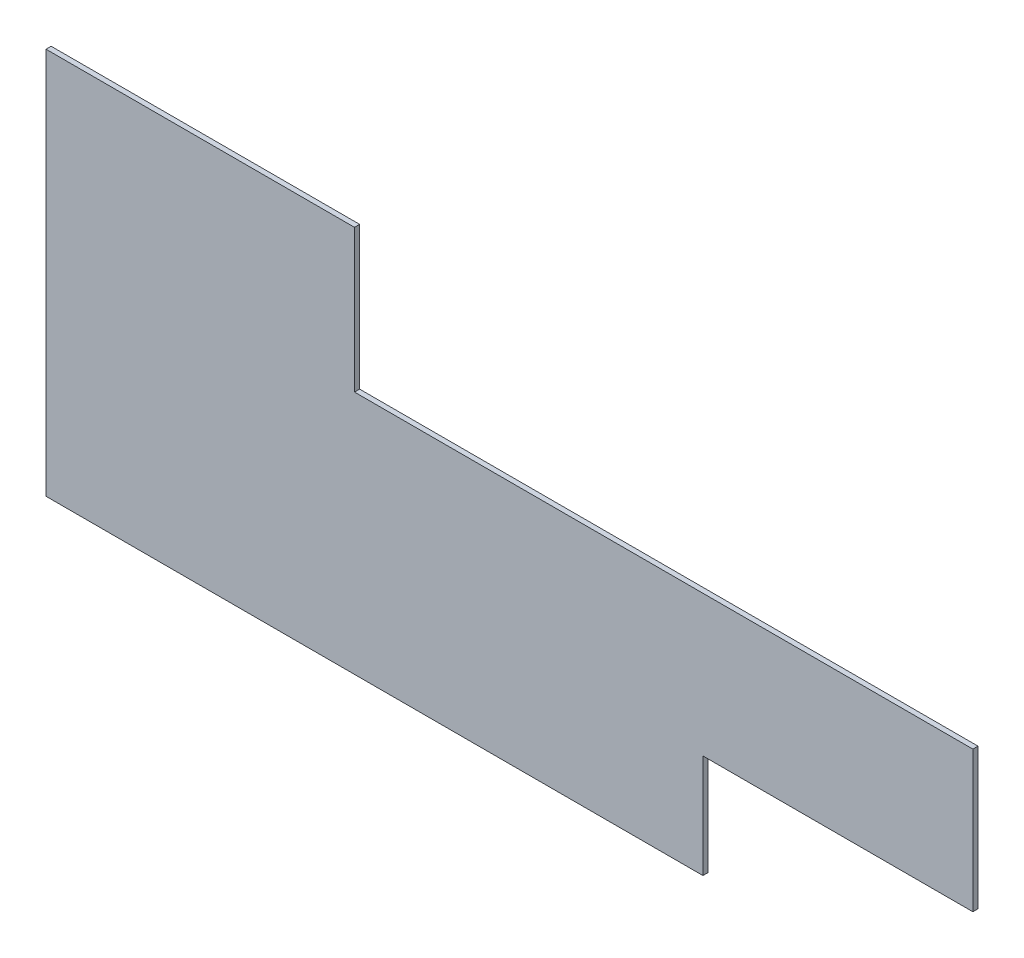
ISO-10303-21;
HEADER;
FILE_DESCRIPTION(('STEP AP214'),'2;1');
FILE_NAME('part.step','',(''),(''),'','','');
FILE_SCHEMA(('AUTOMOTIVE_DESIGN { 1 0 10303 214 1 1 1 1 }'));
ENDSEC;
DATA;
#1=APPLICATION_CONTEXT('core data for automotive mechanical design processes');
#2=APPLICATION_PROTOCOL_DEFINITION('international standard','automotive_design',2000,#1);
#3=PRODUCT_CONTEXT('',#1,'mechanical');
#4=PRODUCT('Part','Part','',(#3));
#5=PRODUCT_RELATED_PRODUCT_CATEGORY('part','',(#4));
#6=PRODUCT_DEFINITION_FORMATION('','',#4);
#7=PRODUCT_DEFINITION_CONTEXT('part definition',#1,'design');
#8=PRODUCT_DEFINITION('design','',#6,#7);
#9=PRODUCT_DEFINITION_SHAPE('','',#8);
#10=(LENGTH_UNIT() NAMED_UNIT(*) SI_UNIT(.MILLI.,.METRE.));
#11=(NAMED_UNIT(*) PLANE_ANGLE_UNIT() SI_UNIT($,.RADIAN.));
#12=(NAMED_UNIT(*) SI_UNIT($,.STERADIAN.) SOLID_ANGLE_UNIT());
#13=UNCERTAINTY_MEASURE_WITH_UNIT(LENGTH_MEASURE(1.E-05),#10,'distance_accuracy_value','');
#14=(GEOMETRIC_REPRESENTATION_CONTEXT(3) GLOBAL_UNCERTAINTY_ASSIGNED_CONTEXT((#13)) GLOBAL_UNIT_ASSIGNED_CONTEXT((#10,
#11,#12)) REPRESENTATION_CONTEXT('',''));
#15=CARTESIAN_POINT('',(0.,0.,0.));
#16=DIRECTION('',(0.,0.,1.));
#17=DIRECTION('',(1.,0.,0.));
#18=AXIS2_PLACEMENT_3D('',#15,#16,#17);
#19=CARTESIAN_POINT('',(0.,-1506.,-20.));
#20=DIRECTION('',(-1.,0.,0.));
#21=DIRECTION('',(0.,-1.,0.));
#22=AXIS2_PLACEMENT_3D('',#19,#20,#21);
#23=PLANE('',#22);
#24=DIRECTION('',(0.,-1.,0.));
#25=VECTOR('',#24,1.);
#26=CARTESIAN_POINT('',(0.,-1506.,0.));
#27=LINE('',#26,#25);
#28=CARTESIAN_POINT('',(0.,0.,0.));
#29=VERTEX_POINT('',#28);
#30=CARTESIAN_POINT('',(0.,-1506.,0.));
#31=VERTEX_POINT('',#30);
#32=EDGE_CURVE('E126',#29,#31,#27,.T.);
#33=ORIENTED_EDGE('',*,*,#32,.F.);
#34=DIRECTION('',(0.,0.,1.));
#35=VECTOR('',#34,1.);
#36=CARTESIAN_POINT('',(0.,0.,-20.));
#37=LINE('',#36,#35);
#38=CARTESIAN_POINT('',(0.,0.,-20.));
#39=VERTEX_POINT('',#38);
#40=EDGE_CURVE('E54',#39,#29,#37,.T.);
#41=ORIENTED_EDGE('',*,*,#40,.F.);
#42=DIRECTION('',(0.,-1.,0.));
#43=VECTOR('',#42,1.);
#44=CARTESIAN_POINT('',(0.,-1506.,-20.));
#45=LINE('',#44,#43);
#46=CARTESIAN_POINT('',(0.,-1506.,-20.));
#47=VERTEX_POINT('',#46);
#48=EDGE_CURVE('E142',#39,#47,#45,.T.);
#49=ORIENTED_EDGE('',*,*,#48,.T.);
#50=DIRECTION('',(0.,0.,1.));
#51=VECTOR('',#50,1.);
#52=CARTESIAN_POINT('',(0.,-1506.,-20.));
#53=LINE('',#52,#51);
#54=EDGE_CURVE('E90',#47,#31,#53,.T.);
#55=ORIENTED_EDGE('',*,*,#54,.T.);
#56=EDGE_LOOP('',(#33,#41,#49,#55));
#57=FACE_BOUND('',#56,.T.);
#58=ADVANCED_FACE('F38',(#57),#23,.T.);
#59=CARTESIAN_POINT('',(0.,0.,-20.));
#60=DIRECTION('',(0.,1.,0.));
#61=DIRECTION('',(0.,0.,1.));
#62=AXIS2_PLACEMENT_3D('',#59,#60,#61);
#63=PLANE('',#62);
#64=DIRECTION('',(-1.,0.,0.));
#65=VECTOR('',#64,1.);
#66=CARTESIAN_POINT('',(0.,0.,0.));
#67=LINE('',#66,#65);
#68=CARTESIAN_POINT('',(1200.,0.,0.));
#69=VERTEX_POINT('',#68);
#70=EDGE_CURVE('E139',#69,#29,#67,.T.);
#71=ORIENTED_EDGE('',*,*,#70,.F.);
#72=DIRECTION('',(0.,0.,1.));
#73=VECTOR('',#72,1.);
#74=CARTESIAN_POINT('',(1200.,0.,-20.));
#75=LINE('',#74,#73);
#76=CARTESIAN_POINT('',(1200.,0.,-20.));
#77=VERTEX_POINT('',#76);
#78=EDGE_CURVE('E78',#77,#69,#75,.T.);
#79=ORIENTED_EDGE('',*,*,#78,.F.);
#80=DIRECTION('',(-1.,0.,0.));
#81=VECTOR('',#80,1.);
#82=CARTESIAN_POINT('',(0.,0.,-20.));
#83=LINE('',#82,#81);
#84=EDGE_CURVE('E116',#77,#39,#83,.T.);
#85=ORIENTED_EDGE('',*,*,#84,.T.);
#86=ORIENTED_EDGE('',*,*,#40,.T.);
#87=EDGE_LOOP('',(#71,#79,#85,#86));
#88=FACE_BOUND('',#87,.T.);
#89=ADVANCED_FACE('F162',(#88),#63,.T.);
#90=CARTESIAN_POINT('',(1200.,0.,-20.));
#91=DIRECTION('',(1.,0.,0.));
#92=DIRECTION('',(0.,0.,-1.));
#93=AXIS2_PLACEMENT_3D('',#90,#91,#92);
#94=PLANE('',#93);
#95=DIRECTION('',(0.,1.,0.));
#96=VECTOR('',#95,1.);
#97=CARTESIAN_POINT('',(1200.,0.,0.));
#98=LINE('',#97,#96);
#99=CARTESIAN_POINT('',(1200.,-555.,0.));
#100=VERTEX_POINT('',#99);
#101=EDGE_CURVE('E102',#100,#69,#98,.T.);
#102=ORIENTED_EDGE('',*,*,#101,.F.);
#103=DIRECTION('',(0.,0.,1.));
#104=VECTOR('',#103,1.);
#105=CARTESIAN_POINT('',(1200.,-555.,-20.));
#106=LINE('',#105,#104);
#107=CARTESIAN_POINT('',(1200.,-555.,-20.));
#108=VERTEX_POINT('',#107);
#109=EDGE_CURVE('E97',#108,#100,#106,.T.);
#110=ORIENTED_EDGE('',*,*,#109,.F.);
#111=DIRECTION('',(0.,1.,0.));
#112=VECTOR('',#111,1.);
#113=CARTESIAN_POINT('',(1200.,0.,-20.));
#114=LINE('',#113,#112);
#115=EDGE_CURVE('E100',#108,#77,#114,.T.);
#116=ORIENTED_EDGE('',*,*,#115,.T.);
#117=ORIENTED_EDGE('',*,*,#78,.T.);
#118=EDGE_LOOP('',(#102,#110,#116,#117));
#119=FACE_BOUND('',#118,.T.);
#120=ADVANCED_FACE('F99',(#119),#94,.T.);
#121=CARTESIAN_POINT('',(1200.,-555.,-20.));
#122=DIRECTION('',(0.,1.,0.));
#123=DIRECTION('',(0.,0.,1.));
#124=AXIS2_PLACEMENT_3D('',#121,#122,#123);
#125=PLANE('',#124);
#126=DIRECTION('',(-1.,0.,0.));
#127=VECTOR('',#126,1.);
#128=CARTESIAN_POINT('',(1200.,-555.,0.));
#129=LINE('',#128,#127);
#130=CARTESIAN_POINT('',(3605.,-555.,0.));
#131=VERTEX_POINT('',#130);
#132=EDGE_CURVE('E136',#131,#100,#129,.T.);
#133=ORIENTED_EDGE('',*,*,#132,.F.);
#134=DIRECTION('',(0.,0.,1.));
#135=VECTOR('',#134,1.);
#136=CARTESIAN_POINT('',(3605.,-555.,-20.));
#137=LINE('',#136,#135);
#138=CARTESIAN_POINT('',(3605.,-555.,-20.));
#139=VERTEX_POINT('',#138);
#140=EDGE_CURVE('E107',#139,#131,#137,.T.);
#141=ORIENTED_EDGE('',*,*,#140,.F.);
#142=DIRECTION('',(-1.,0.,0.));
#143=VECTOR('',#142,1.);
#144=CARTESIAN_POINT('',(1200.,-555.,-20.));
#145=LINE('',#144,#143);
#146=EDGE_CURVE('E114',#139,#108,#145,.T.);
#147=ORIENTED_EDGE('',*,*,#146,.T.);
#148=ORIENTED_EDGE('',*,*,#109,.T.);
#149=EDGE_LOOP('',(#133,#141,#147,#148));
#150=FACE_BOUND('',#149,.T.);
#151=ADVANCED_FACE('F118',(#150),#125,.T.);
#152=CARTESIAN_POINT('',(3605.,-555.,-20.));
#153=DIRECTION('',(1.,0.,0.));
#154=DIRECTION('',(0.,0.,-1.));
#155=AXIS2_PLACEMENT_3D('',#152,#153,#154);
#156=PLANE('',#155);
#157=DIRECTION('',(0.,1.,0.));
#158=VECTOR('',#157,1.);
#159=CARTESIAN_POINT('',(3605.,-555.,0.));
#160=LINE('',#159,#158);
#161=CARTESIAN_POINT('',(3605.,-1103.,0.));
#162=VERTEX_POINT('',#161);
#163=EDGE_CURVE('E133',#162,#131,#160,.T.);
#164=ORIENTED_EDGE('',*,*,#163,.F.);
#165=DIRECTION('',(0.,0.,1.));
#166=VECTOR('',#165,1.);
#167=CARTESIAN_POINT('',(3605.,-1103.,-20.));
#168=LINE('',#167,#166);
#169=CARTESIAN_POINT('',(3605.,-1103.,-20.));
#170=VERTEX_POINT('',#169);
#171=EDGE_CURVE('E146',#170,#162,#168,.T.);
#172=ORIENTED_EDGE('',*,*,#171,.F.);
#173=DIRECTION('',(0.,1.,0.));
#174=VECTOR('',#173,1.);
#175=CARTESIAN_POINT('',(3605.,-555.,-20.));
#176=LINE('',#175,#174);
#177=EDGE_CURVE('E119',#170,#139,#176,.T.);
#178=ORIENTED_EDGE('',*,*,#177,.T.);
#179=ORIENTED_EDGE('',*,*,#140,.T.);
#180=EDGE_LOOP('',(#164,#172,#178,#179));
#181=FACE_BOUND('',#180,.T.);
#182=ADVANCED_FACE('F160',(#181),#156,.T.);
#183=CARTESIAN_POINT('',(6010.,-1506.,-20.));
#184=DIRECTION('',(0.,-1.,0.));
#185=DIRECTION('',(1.,0.,0.));
#186=AXIS2_PLACEMENT_3D('',#183,#184,#185);
#187=PLANE('',#186);
#188=DIRECTION('',(0.,0.,1.));
#189=VECTOR('',#188,1.);
#190=CARTESIAN_POINT('',(2555.,-1506.,-20.));
#191=LINE('',#190,#189);
#192=CARTESIAN_POINT('',(2555.,-1506.,-20.));
#193=VERTEX_POINT('',#192);
#194=CARTESIAN_POINT('',(2555.,-1506.,0.));
#195=VERTEX_POINT('',#194);
#196=EDGE_CURVE('E130',#193,#195,#191,.T.);
#197=ORIENTED_EDGE('',*,*,#196,.T.);
#198=DIRECTION('',(1.,0.,0.));
#199=VECTOR('',#198,1.);
#200=CARTESIAN_POINT('',(6010.,-1506.,0.));
#201=LINE('',#200,#199);
#202=EDGE_CURVE('E129',#31,#195,#201,.T.);
#203=ORIENTED_EDGE('',*,*,#202,.F.);
#204=ORIENTED_EDGE('',*,*,#54,.F.);
#205=DIRECTION('',(1.,0.,0.));
#206=VECTOR('',#205,1.);
#207=CARTESIAN_POINT('',(6010.,-1506.,-20.));
#208=LINE('',#207,#206);
#209=EDGE_CURVE('E121',#47,#193,#208,.T.);
#210=ORIENTED_EDGE('',*,*,#209,.T.);
#211=EDGE_LOOP('',(#197,#203,#204,#210));
#212=FACE_BOUND('',#211,.T.);
#213=ADVANCED_FACE('F176',(#212),#187,.T.);
#214=CARTESIAN_POINT('',(0.,0.,-20.));
#215=DIRECTION('',(0.,0.,-1.));
#216=DIRECTION('',(-1.,0.,0.));
#217=AXIS2_PLACEMENT_3D('',#214,#215,#216);
#218=PLANE('',#217);
#219=DIRECTION('',(0.,-1.,0.));
#220=VECTOR('',#219,1.);
#221=CARTESIAN_POINT('',(2555.,-1103.,-20.));
#222=LINE('',#221,#220);
#223=CARTESIAN_POINT('',(2555.,-1103.,-20.));
#224=VERTEX_POINT('',#223);
#225=EDGE_CURVE('E190',#224,#193,#222,.T.);
#226=ORIENTED_EDGE('',*,*,#225,.T.);
#227=ORIENTED_EDGE('',*,*,#209,.F.);
#228=ORIENTED_EDGE('',*,*,#48,.F.);
#229=ORIENTED_EDGE('',*,*,#84,.F.);
#230=ORIENTED_EDGE('',*,*,#115,.F.);
#231=ORIENTED_EDGE('',*,*,#146,.F.);
#232=ORIENTED_EDGE('',*,*,#177,.F.);
#233=DIRECTION('',(-1.,0.,0.));
#234=VECTOR('',#233,1.);
#235=CARTESIAN_POINT('',(6010.,-1103.,-20.));
#236=LINE('',#235,#234);
#237=EDGE_CURVE('E193',#170,#224,#236,.T.);
#238=ORIENTED_EDGE('',*,*,#237,.T.);
#239=EDGE_LOOP('',(#226,#227,#228,#229,#230,#231,#232,#238));
#240=FACE_BOUND('',#239,.T.);
#241=ADVANCED_FACE('F112',(#240),#218,.T.);
#242=CARTESIAN_POINT('',(0.,0.,0.));
#243=DIRECTION('',(0.,0.,-1.));
#244=DIRECTION('',(-1.,0.,0.));
#245=AXIS2_PLACEMENT_3D('',#242,#243,#244);
#246=PLANE('',#245);
#247=ORIENTED_EDGE('',*,*,#202,.T.);
#248=DIRECTION('',(0.,1.,0.));
#249=VECTOR('',#248,1.);
#250=CARTESIAN_POINT('',(2555.,0.,0.));
#251=LINE('',#250,#249);
#252=CARTESIAN_POINT('',(2555.,-1103.,0.));
#253=VERTEX_POINT('',#252);
#254=EDGE_CURVE('E11',#195,#253,#251,.T.);
#255=ORIENTED_EDGE('',*,*,#254,.T.);
#256=DIRECTION('',(1.,0.,0.));
#257=VECTOR('',#256,1.);
#258=CARTESIAN_POINT('',(1.41774355561395E-13,-1103.,0.));
#259=LINE('',#258,#257);
#260=EDGE_CURVE('E46',#253,#162,#259,.T.);
#261=ORIENTED_EDGE('',*,*,#260,.T.);
#262=ORIENTED_EDGE('',*,*,#163,.T.);
#263=ORIENTED_EDGE('',*,*,#132,.T.);
#264=ORIENTED_EDGE('',*,*,#101,.T.);
#265=ORIENTED_EDGE('',*,*,#70,.T.);
#266=ORIENTED_EDGE('',*,*,#32,.T.);
#267=EDGE_LOOP('',(#247,#255,#261,#262,#263,#264,#265,#266));
#268=FACE_BOUND('',#267,.T.);
#269=ADVANCED_FACE('F152',(#268),#246,.F.);
#270=CARTESIAN_POINT('',(2555.,-1103.,-20.));
#271=DIRECTION('',(-1.,0.,0.));
#272=DIRECTION('',(0.,0.,1.));
#273=AXIS2_PLACEMENT_3D('',#270,#271,#272);
#274=PLANE('',#273);
#275=ORIENTED_EDGE('',*,*,#196,.F.);
#276=ORIENTED_EDGE('',*,*,#225,.F.);
#277=DIRECTION('',(0.,0.,1.));
#278=VECTOR('',#277,1.);
#279=CARTESIAN_POINT('',(2555.,-1103.,-20.));
#280=LINE('',#279,#278);
#281=EDGE_CURVE('E186',#224,#253,#280,.T.);
#282=ORIENTED_EDGE('',*,*,#281,.T.);
#283=ORIENTED_EDGE('',*,*,#254,.F.);
#284=EDGE_LOOP('',(#275,#276,#282,#283));
#285=FACE_BOUND('',#284,.T.);
#286=ADVANCED_FACE('F201',(#285),#274,.F.);
#287=CARTESIAN_POINT('',(6010.,-1103.,-20.));
#288=DIRECTION('',(0.,1.,0.));
#289=DIRECTION('',(-1.,0.,0.));
#290=AXIS2_PLACEMENT_3D('',#287,#288,#289);
#291=PLANE('',#290);
#292=ORIENTED_EDGE('',*,*,#171,.T.);
#293=ORIENTED_EDGE('',*,*,#260,.F.);
#294=ORIENTED_EDGE('',*,*,#281,.F.);
#295=ORIENTED_EDGE('',*,*,#237,.F.);
#296=EDGE_LOOP('',(#292,#293,#294,#295));
#297=FACE_BOUND('',#296,.T.);
#298=ADVANCED_FACE('F198',(#297),#291,.F.);
#299=CLOSED_SHELL('',(#58,#89,#120,#151,#182,#213,#241,#269,#286,#298));
#300=MANIFOLD_SOLID_BREP('B2',#299);
#301=ADVANCED_BREP_SHAPE_REPRESENTATION('',(#18,#300),#14);
#302=SHAPE_DEFINITION_REPRESENTATION(#9,#301);
ENDSEC;
END-ISO-10303-21;
